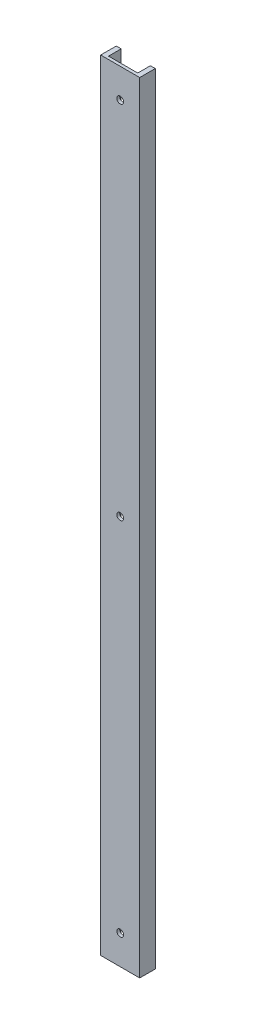
ISO-10303-21;
HEADER;
FILE_DESCRIPTION(('STEP AP214'),'2;1');
FILE_NAME('part.step','',(''),(''),'','','');
FILE_SCHEMA(('AUTOMOTIVE_DESIGN { 1 0 10303 214 1 1 1 1 }'));
ENDSEC;
DATA;
#1=APPLICATION_CONTEXT('core data for automotive mechanical design processes');
#2=APPLICATION_PROTOCOL_DEFINITION('international standard','automotive_design',2000,#1);
#3=PRODUCT_CONTEXT('',#1,'mechanical');
#4=PRODUCT('Part','Part','',(#3));
#5=PRODUCT_RELATED_PRODUCT_CATEGORY('part','',(#4));
#6=PRODUCT_DEFINITION_FORMATION('','',#4);
#7=PRODUCT_DEFINITION_CONTEXT('part definition',#1,'design');
#8=PRODUCT_DEFINITION('design','',#6,#7);
#9=PRODUCT_DEFINITION_SHAPE('','',#8);
#10=(LENGTH_UNIT() NAMED_UNIT(*) SI_UNIT(.MILLI.,.METRE.));
#11=(NAMED_UNIT(*) PLANE_ANGLE_UNIT() SI_UNIT($,.RADIAN.));
#12=(NAMED_UNIT(*) SI_UNIT($,.STERADIAN.) SOLID_ANGLE_UNIT());
#13=UNCERTAINTY_MEASURE_WITH_UNIT(LENGTH_MEASURE(1.E-05),#10,'distance_accuracy_value','');
#14=(GEOMETRIC_REPRESENTATION_CONTEXT(3) GLOBAL_UNCERTAINTY_ASSIGNED_CONTEXT((#13)) GLOBAL_UNIT_ASSIGNED_CONTEXT((#10,
#11,#12)) REPRESENTATION_CONTEXT('',''));
#15=CARTESIAN_POINT('',(0.,0.,0.));
#16=DIRECTION('',(0.,0.,1.));
#17=DIRECTION('',(1.,0.,0.));
#18=AXIS2_PLACEMENT_3D('',#15,#16,#17);
#19=CARTESIAN_POINT('',(0.,400.,-8.));
#20=DIRECTION('',(0.,0.,1.));
#21=DIRECTION('',(1.,0.,0.));
#22=AXIS2_PLACEMENT_3D('',#19,#20,#21);
#23=PLANE('',#22);
#24=DIRECTION('',(-1.,0.,0.));
#25=VECTOR('',#24,1.);
#26=CARTESIAN_POINT('',(0.,400.,-8.));
#27=LINE('',#26,#25);
#28=CARTESIAN_POINT('',(2.5,400.,-8.));
#29=VERTEX_POINT('',#28);
#30=CARTESIAN_POINT('',(0.,400.,-8.));
#31=VERTEX_POINT('',#30);
#32=EDGE_CURVE('E57',#29,#31,#27,.T.);
#33=ORIENTED_EDGE('',*,*,#32,.F.);
#34=DIRECTION('',(0.,-1.,0.));
#35=VECTOR('',#34,1.);
#36=CARTESIAN_POINT('',(2.5,400.,-8.));
#37=LINE('',#36,#35);
#38=CARTESIAN_POINT('',(2.5,0.,-8.));
#39=VERTEX_POINT('',#38);
#40=EDGE_CURVE('E148',#29,#39,#37,.T.);
#41=ORIENTED_EDGE('',*,*,#40,.T.);
#42=DIRECTION('',(-1.,0.,0.));
#43=VECTOR('',#42,1.);
#44=CARTESIAN_POINT('',(0.,0.,-8.));
#45=LINE('',#44,#43);
#46=CARTESIAN_POINT('',(0.,0.,-8.));
#47=VERTEX_POINT('',#46);
#48=EDGE_CURVE('E79',#39,#47,#45,.T.);
#49=ORIENTED_EDGE('',*,*,#48,.T.);
#50=DIRECTION('',(0.,-1.,0.));
#51=VECTOR('',#50,1.);
#52=CARTESIAN_POINT('',(0.,400.,-8.));
#53=LINE('',#52,#51);
#54=EDGE_CURVE('E136',#31,#47,#53,.T.);
#55=ORIENTED_EDGE('',*,*,#54,.F.);
#56=EDGE_LOOP('',(#33,#41,#49,#55));
#57=FACE_BOUND('',#56,.T.);
#58=ADVANCED_FACE('F33',(#57),#23,.F.);
#59=CARTESIAN_POINT('',(0.,400.,0.));
#60=DIRECTION('',(1.,0.,0.));
#61=DIRECTION('',(0.,0.,-1.));
#62=AXIS2_PLACEMENT_3D('',#59,#60,#61);
#63=PLANE('',#62);
#64=DIRECTION('',(0.,0.,1.));
#65=VECTOR('',#64,1.);
#66=CARTESIAN_POINT('',(0.,0.,0.));
#67=LINE('',#66,#65);
#68=CARTESIAN_POINT('',(0.,0.,0.));
#69=VERTEX_POINT('',#68);
#70=EDGE_CURVE('E126',#47,#69,#67,.T.);
#71=ORIENTED_EDGE('',*,*,#70,.T.);
#72=DIRECTION('',(0.,-1.,0.));
#73=VECTOR('',#72,1.);
#74=CARTESIAN_POINT('',(0.,400.,0.));
#75=LINE('',#74,#73);
#76=CARTESIAN_POINT('',(0.,400.,0.));
#77=VERTEX_POINT('',#76);
#78=EDGE_CURVE('E41',#77,#69,#75,.T.);
#79=ORIENTED_EDGE('',*,*,#78,.F.);
#80=DIRECTION('',(0.,0.,1.));
#81=VECTOR('',#80,1.);
#82=CARTESIAN_POINT('',(0.,400.,0.));
#83=LINE('',#82,#81);
#84=EDGE_CURVE('E131',#31,#77,#83,.T.);
#85=ORIENTED_EDGE('',*,*,#84,.F.);
#86=ORIENTED_EDGE('',*,*,#54,.T.);
#87=EDGE_LOOP('',(#71,#79,#85,#86));
#88=FACE_BOUND('',#87,.T.);
#89=ADVANCED_FACE('F35',(#88),#63,.F.);
#90=CARTESIAN_POINT('',(0.,400.,0.));
#91=DIRECTION('',(0.,0.,-1.));
#92=DIRECTION('',(-1.,0.,0.));
#93=AXIS2_PLACEMENT_3D('',#90,#91,#92);
#94=PLANE('',#93);
#95=CARTESIAN_POINT('',(9.99999999999995,15.,0.));
#96=DIRECTION('',(0.,0.,-1.));
#97=DIRECTION('',(-1.,0.,0.));
#98=AXIS2_PLACEMENT_3D('',#95,#96,#97);
#99=CIRCLE('',#98,1.75);
#100=CARTESIAN_POINT('',(8.24999999999995,15.,0.));
#101=VERTEX_POINT('',#100);
#102=EDGE_CURVE('E177',#101,#101,#99,.T.);
#103=ORIENTED_EDGE('',*,*,#102,.T.);
#104=EDGE_LOOP('',(#103));
#105=FACE_BOUND('',#104,.T.);
#106=CARTESIAN_POINT('',(10.,200.,0.));
#107=DIRECTION('',(0.,0.,-1.));
#108=DIRECTION('',(-1.,0.,0.));
#109=AXIS2_PLACEMENT_3D('',#106,#107,#108);
#110=CIRCLE('',#109,1.75);
#111=CARTESIAN_POINT('',(8.25,200.,0.));
#112=VERTEX_POINT('',#111);
#113=EDGE_CURVE('E171',#112,#112,#110,.T.);
#114=ORIENTED_EDGE('',*,*,#113,.T.);
#115=EDGE_LOOP('',(#114));
#116=FACE_BOUND('',#115,.T.);
#117=CARTESIAN_POINT('',(10.,385.,0.));
#118=DIRECTION('',(0.,0.,-1.));
#119=DIRECTION('',(-1.,0.,0.));
#120=AXIS2_PLACEMENT_3D('',#117,#118,#119);
#121=CIRCLE('',#120,1.75);
#122=CARTESIAN_POINT('',(8.25,385.,0.));
#123=VERTEX_POINT('',#122);
#124=EDGE_CURVE('E166',#123,#123,#121,.T.);
#125=ORIENTED_EDGE('',*,*,#124,.T.);
#126=EDGE_LOOP('',(#125));
#127=FACE_BOUND('',#126,.T.);
#128=DIRECTION('',(1.,0.,0.));
#129=VECTOR('',#128,1.);
#130=CARTESIAN_POINT('',(0.,0.,0.));
#131=LINE('',#130,#129);
#132=CARTESIAN_POINT('',(20.,0.,0.));
#133=VERTEX_POINT('',#132);
#134=EDGE_CURVE('E132',#69,#133,#131,.T.);
#135=ORIENTED_EDGE('',*,*,#134,.T.);
#136=DIRECTION('',(0.,-1.,0.));
#137=VECTOR('',#136,1.);
#138=CARTESIAN_POINT('',(20.,400.,0.));
#139=LINE('',#138,#137);
#140=CARTESIAN_POINT('',(20.,400.,0.));
#141=VERTEX_POINT('',#140);
#142=EDGE_CURVE('E142',#141,#133,#139,.T.);
#143=ORIENTED_EDGE('',*,*,#142,.F.);
#144=DIRECTION('',(1.,0.,0.));
#145=VECTOR('',#144,1.);
#146=CARTESIAN_POINT('',(0.,400.,0.));
#147=LINE('',#146,#145);
#148=EDGE_CURVE('E87',#77,#141,#147,.T.);
#149=ORIENTED_EDGE('',*,*,#148,.F.);
#150=ORIENTED_EDGE('',*,*,#78,.T.);
#151=EDGE_LOOP('',(#135,#143,#149,#150));
#152=FACE_BOUND('',#151,.T.);
#153=ADVANCED_FACE('F145',(#105,#116,#127,#152),#94,.F.);
#154=CARTESIAN_POINT('',(20.,400.,0.));
#155=DIRECTION('',(-1.,0.,0.));
#156=DIRECTION('',(0.,0.,1.));
#157=AXIS2_PLACEMENT_3D('',#154,#155,#156);
#158=PLANE('',#157);
#159=DIRECTION('',(0.,0.,-1.));
#160=VECTOR('',#159,1.);
#161=CARTESIAN_POINT('',(20.,0.,0.));
#162=LINE('',#161,#160);
#163=CARTESIAN_POINT('',(20.,0.,-8.));
#164=VERTEX_POINT('',#163);
#165=EDGE_CURVE('E128',#133,#164,#162,.T.);
#166=ORIENTED_EDGE('',*,*,#165,.T.);
#167=DIRECTION('',(0.,-1.,0.));
#168=VECTOR('',#167,1.);
#169=CARTESIAN_POINT('',(20.,400.,-8.));
#170=LINE('',#169,#168);
#171=CARTESIAN_POINT('',(20.,400.,-8.));
#172=VERTEX_POINT('',#171);
#173=EDGE_CURVE('E138',#172,#164,#170,.T.);
#174=ORIENTED_EDGE('',*,*,#173,.F.);
#175=DIRECTION('',(0.,0.,-1.));
#176=VECTOR('',#175,1.);
#177=CARTESIAN_POINT('',(20.,400.,0.));
#178=LINE('',#177,#176);
#179=EDGE_CURVE('E155',#141,#172,#178,.T.);
#180=ORIENTED_EDGE('',*,*,#179,.F.);
#181=ORIENTED_EDGE('',*,*,#142,.T.);
#182=EDGE_LOOP('',(#166,#174,#180,#181));
#183=FACE_BOUND('',#182,.T.);
#184=ADVANCED_FACE('F224',(#183),#158,.F.);
#185=CARTESIAN_POINT('',(17.5,0.,-8.));
#186=VERTEX_POINT('',#185);
#187=EDGE_CURVE('E127',#164,#186,#45,.T.);
#188=ORIENTED_EDGE('',*,*,#187,.T.);
#189=DIRECTION('',(0.,1.,0.));
#190=VECTOR('',#189,1.);
#191=CARTESIAN_POINT('',(17.5,400.,-8.));
#192=LINE('',#191,#190);
#193=CARTESIAN_POINT('',(17.5,400.,-8.));
#194=VERTEX_POINT('',#193);
#195=EDGE_CURVE('E150',#186,#194,#192,.T.);
#196=ORIENTED_EDGE('',*,*,#195,.T.);
#197=EDGE_CURVE('E139',#172,#194,#27,.T.);
#198=ORIENTED_EDGE('',*,*,#197,.F.);
#199=ORIENTED_EDGE('',*,*,#173,.T.);
#200=EDGE_LOOP('',(#188,#196,#198,#199));
#201=FACE_BOUND('',#200,.T.);
#202=ADVANCED_FACE('F216',(#201),#23,.F.);
#203=CARTESIAN_POINT('',(0.,400.,0.));
#204=DIRECTION('',(0.,-1.,0.));
#205=DIRECTION('',(0.,0.,-1.));
#206=AXIS2_PLACEMENT_3D('',#203,#204,#205);
#207=PLANE('',#206);
#208=DIRECTION('',(1.,0.,0.));
#209=VECTOR('',#208,1.);
#210=CARTESIAN_POINT('',(17.5,400.,-1.5));
#211=LINE('',#210,#209);
#212=CARTESIAN_POINT('',(2.5,400.,-1.5));
#213=VERTEX_POINT('',#212);
#214=CARTESIAN_POINT('',(17.5,400.,-1.5));
#215=VERTEX_POINT('',#214);
#216=EDGE_CURVE('E163',#213,#215,#211,.T.);
#217=ORIENTED_EDGE('',*,*,#216,.F.);
#218=DIRECTION('',(0.,0.,1.));
#219=VECTOR('',#218,1.);
#220=CARTESIAN_POINT('',(2.5,400.,-14.5));
#221=LINE('',#220,#219);
#222=EDGE_CURVE('E111',#29,#213,#221,.T.);
#223=ORIENTED_EDGE('',*,*,#222,.F.);
#224=ORIENTED_EDGE('',*,*,#32,.T.);
#225=ORIENTED_EDGE('',*,*,#84,.T.);
#226=ORIENTED_EDGE('',*,*,#148,.T.);
#227=ORIENTED_EDGE('',*,*,#179,.T.);
#228=ORIENTED_EDGE('',*,*,#197,.T.);
#229=DIRECTION('',(0.,0.,-1.));
#230=VECTOR('',#229,1.);
#231=CARTESIAN_POINT('',(17.5,400.,-14.5));
#232=LINE('',#231,#230);
#233=EDGE_CURVE('E121',#215,#194,#232,.T.);
#234=ORIENTED_EDGE('',*,*,#233,.F.);
#235=EDGE_LOOP('',(#217,#223,#224,#225,#226,#227,#228,#234));
#236=FACE_BOUND('',#235,.T.);
#237=ADVANCED_FACE('F223',(#236),#207,.F.);
#238=CARTESIAN_POINT('',(0.,0.,0.));
#239=DIRECTION('',(0.,-1.,0.));
#240=DIRECTION('',(0.,0.,-1.));
#241=AXIS2_PLACEMENT_3D('',#238,#239,#240);
#242=PLANE('',#241);
#243=DIRECTION('',(0.,0.,-1.));
#244=VECTOR('',#243,1.);
#245=CARTESIAN_POINT('',(2.5,0.,0.));
#246=LINE('',#245,#244);
#247=CARTESIAN_POINT('',(2.5,0.,-1.5));
#248=VERTEX_POINT('',#247);
#249=EDGE_CURVE('E11',#248,#39,#246,.T.);
#250=ORIENTED_EDGE('',*,*,#249,.F.);
#251=DIRECTION('',(1.,0.,0.));
#252=VECTOR('',#251,1.);
#253=CARTESIAN_POINT('',(17.5,0.,-1.5));
#254=LINE('',#253,#252);
#255=CARTESIAN_POINT('',(17.5,0.,-1.5));
#256=VERTEX_POINT('',#255);
#257=EDGE_CURVE('E118',#248,#256,#254,.T.);
#258=ORIENTED_EDGE('',*,*,#257,.T.);
#259=DIRECTION('',(0.,0.,-1.));
#260=VECTOR('',#259,1.);
#261=CARTESIAN_POINT('',(17.5,0.,-14.5));
#262=LINE('',#261,#260);
#263=EDGE_CURVE('E48',#256,#186,#262,.T.);
#264=ORIENTED_EDGE('',*,*,#263,.T.);
#265=ORIENTED_EDGE('',*,*,#187,.F.);
#266=ORIENTED_EDGE('',*,*,#165,.F.);
#267=ORIENTED_EDGE('',*,*,#134,.F.);
#268=ORIENTED_EDGE('',*,*,#70,.F.);
#269=ORIENTED_EDGE('',*,*,#48,.F.);
#270=EDGE_LOOP('',(#250,#258,#264,#265,#266,#267,#268,#269));
#271=FACE_BOUND('',#270,.T.);
#272=ADVANCED_FACE('F123',(#271),#242,.T.);
#273=CARTESIAN_POINT('',(2.5,0.,-14.5));
#274=DIRECTION('',(-1.,0.,0.));
#275=DIRECTION('',(0.,0.,1.));
#276=AXIS2_PLACEMENT_3D('',#273,#274,#275);
#277=PLANE('',#276);
#278=ORIENTED_EDGE('',*,*,#222,.T.);
#279=DIRECTION('',(0.,1.,0.));
#280=VECTOR('',#279,1.);
#281=CARTESIAN_POINT('',(2.5,0.,-1.5));
#282=LINE('',#281,#280);
#283=EDGE_CURVE('E107',#248,#213,#282,.T.);
#284=ORIENTED_EDGE('',*,*,#283,.F.);
#285=ORIENTED_EDGE('',*,*,#249,.T.);
#286=ORIENTED_EDGE('',*,*,#40,.F.);
#287=EDGE_LOOP('',(#278,#284,#285,#286));
#288=FACE_BOUND('',#287,.T.);
#289=ADVANCED_FACE('F109',(#288),#277,.F.);
#290=CARTESIAN_POINT('',(17.5,0.,-14.5));
#291=DIRECTION('',(1.,0.,0.));
#292=DIRECTION('',(0.,0.,-1.));
#293=AXIS2_PLACEMENT_3D('',#290,#291,#292);
#294=PLANE('',#293);
#295=ORIENTED_EDGE('',*,*,#263,.F.);
#296=DIRECTION('',(0.,1.,0.));
#297=VECTOR('',#296,1.);
#298=CARTESIAN_POINT('',(17.5,0.,-1.5));
#299=LINE('',#298,#297);
#300=EDGE_CURVE('E115',#256,#215,#299,.T.);
#301=ORIENTED_EDGE('',*,*,#300,.T.);
#302=ORIENTED_EDGE('',*,*,#233,.T.);
#303=ORIENTED_EDGE('',*,*,#195,.F.);
#304=EDGE_LOOP('',(#295,#301,#302,#303));
#305=FACE_BOUND('',#304,.T.);
#306=ADVANCED_FACE('F198',(#305),#294,.F.);
#307=CARTESIAN_POINT('',(17.5,0.,-1.5));
#308=DIRECTION('',(0.,0.,1.));
#309=DIRECTION('',(1.,0.,0.));
#310=AXIS2_PLACEMENT_3D('',#307,#308,#309);
#311=PLANE('',#310);
#312=CARTESIAN_POINT('',(9.99999999999995,15.,-1.5));
#313=DIRECTION('',(0.,0.,-1.));
#314=DIRECTION('',(-1.,0.,0.));
#315=AXIS2_PLACEMENT_3D('',#312,#313,#314);
#316=CIRCLE('',#315,1.75);
#317=CARTESIAN_POINT('',(8.24999999999995,15.,-1.5));
#318=VERTEX_POINT('',#317);
#319=EDGE_CURVE('E180',#318,#318,#316,.T.);
#320=ORIENTED_EDGE('',*,*,#319,.F.);
#321=EDGE_LOOP('',(#320));
#322=FACE_BOUND('',#321,.T.);
#323=CARTESIAN_POINT('',(10.,200.,-1.5));
#324=DIRECTION('',(0.,0.,-1.));
#325=DIRECTION('',(-1.,0.,0.));
#326=AXIS2_PLACEMENT_3D('',#323,#324,#325);
#327=CIRCLE('',#326,1.75);
#328=CARTESIAN_POINT('',(8.25,200.,-1.5));
#329=VERTEX_POINT('',#328);
#330=EDGE_CURVE('E174',#329,#329,#327,.T.);
#331=ORIENTED_EDGE('',*,*,#330,.F.);
#332=EDGE_LOOP('',(#331));
#333=FACE_BOUND('',#332,.T.);
#334=CARTESIAN_POINT('',(10.,385.,-1.5));
#335=DIRECTION('',(0.,0.,-1.));
#336=DIRECTION('',(-1.,0.,0.));
#337=AXIS2_PLACEMENT_3D('',#334,#335,#336);
#338=CIRCLE('',#337,1.75);
#339=CARTESIAN_POINT('',(8.25,385.,-1.5));
#340=VERTEX_POINT('',#339);
#341=EDGE_CURVE('E168',#340,#340,#338,.T.);
#342=ORIENTED_EDGE('',*,*,#341,.F.);
#343=EDGE_LOOP('',(#342));
#344=FACE_BOUND('',#343,.T.);
#345=ORIENTED_EDGE('',*,*,#216,.T.);
#346=ORIENTED_EDGE('',*,*,#300,.F.);
#347=ORIENTED_EDGE('',*,*,#257,.F.);
#348=ORIENTED_EDGE('',*,*,#283,.T.);
#349=EDGE_LOOP('',(#345,#346,#347,#348));
#350=FACE_BOUND('',#349,.T.);
#351=ADVANCED_FACE('F119',(#322,#333,#344,#350),#311,.F.);
#352=CARTESIAN_POINT('',(10.,385.,0.));
#353=DIRECTION('',(0.,0.,-1.));
#354=DIRECTION('',(-1.,0.,0.));
#355=AXIS2_PLACEMENT_3D('',#352,#353,#354);
#356=CYLINDRICAL_SURFACE('',#355,1.75);
#357=ORIENTED_EDGE('',*,*,#124,.F.);
#358=EDGE_LOOP('',(#357));
#359=FACE_BOUND('',#358,.T.);
#360=ORIENTED_EDGE('',*,*,#341,.T.);
#361=EDGE_LOOP('',(#360));
#362=FACE_BOUND('',#361,.T.);
#363=ADVANCED_FACE('F197',(#359,#362),#356,.F.);
#364=CARTESIAN_POINT('',(10.,200.,0.));
#365=DIRECTION('',(0.,0.,-1.));
#366=DIRECTION('',(-1.,0.,0.));
#367=AXIS2_PLACEMENT_3D('',#364,#365,#366);
#368=CYLINDRICAL_SURFACE('',#367,1.75);
#369=ORIENTED_EDGE('',*,*,#113,.F.);
#370=EDGE_LOOP('',(#369));
#371=FACE_BOUND('',#370,.T.);
#372=ORIENTED_EDGE('',*,*,#330,.T.);
#373=EDGE_LOOP('',(#372));
#374=FACE_BOUND('',#373,.T.);
#375=ADVANCED_FACE('F191',(#371,#374),#368,.F.);
#376=CARTESIAN_POINT('',(9.99999999999995,15.,0.));
#377=DIRECTION('',(0.,0.,-1.));
#378=DIRECTION('',(-1.,0.,0.));
#379=AXIS2_PLACEMENT_3D('',#376,#377,#378);
#380=CYLINDRICAL_SURFACE('',#379,1.75);
#381=ORIENTED_EDGE('',*,*,#102,.F.);
#382=EDGE_LOOP('',(#381));
#383=FACE_BOUND('',#382,.T.);
#384=ORIENTED_EDGE('',*,*,#319,.T.);
#385=EDGE_LOOP('',(#384));
#386=FACE_BOUND('',#385,.T.);
#387=ADVANCED_FACE('F188',(#383,#386),#380,.F.);
#388=CLOSED_SHELL('',(#58,#89,#153,#184,#202,#237,#272,#289,#306,#351,#363,#375,#387));
#389=MANIFOLD_SOLID_BREP('B2',#388);
#390=ADVANCED_BREP_SHAPE_REPRESENTATION('',(#18,#389),#14);
#391=SHAPE_DEFINITION_REPRESENTATION(#9,#390);
ENDSEC;
END-ISO-10303-21;
